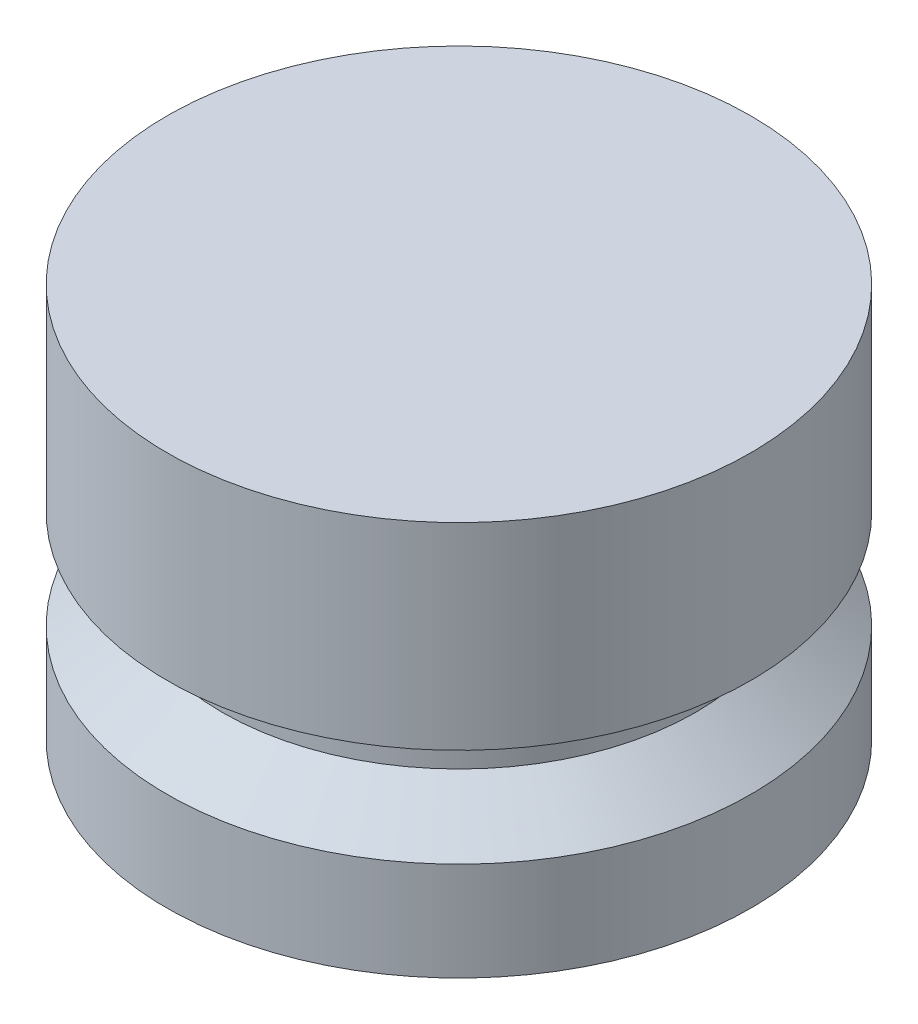
ISO-10303-21;
HEADER;
FILE_DESCRIPTION(('STEP AP214'),'2;1');
FILE_NAME('part.step','',(''),(''),'','','');
FILE_SCHEMA(('AUTOMOTIVE_DESIGN { 1 0 10303 214 1 1 1 1 }'));
ENDSEC;
DATA;
#1=APPLICATION_CONTEXT('core data for automotive mechanical design processes');
#2=APPLICATION_PROTOCOL_DEFINITION('international standard','automotive_design',2000,#1);
#3=PRODUCT_CONTEXT('',#1,'mechanical');
#4=PRODUCT('Part','Part','',(#3));
#5=PRODUCT_RELATED_PRODUCT_CATEGORY('part','',(#4));
#6=PRODUCT_DEFINITION_FORMATION('','',#4);
#7=PRODUCT_DEFINITION_CONTEXT('part definition',#1,'design');
#8=PRODUCT_DEFINITION('design','',#6,#7);
#9=PRODUCT_DEFINITION_SHAPE('','',#8);
#10=(LENGTH_UNIT() NAMED_UNIT(*) SI_UNIT(.MILLI.,.METRE.));
#11=(NAMED_UNIT(*) PLANE_ANGLE_UNIT() SI_UNIT($,.RADIAN.));
#12=(NAMED_UNIT(*) SI_UNIT($,.STERADIAN.) SOLID_ANGLE_UNIT());
#13=UNCERTAINTY_MEASURE_WITH_UNIT(LENGTH_MEASURE(1.E-05),#10,'distance_accuracy_value','');
#14=(GEOMETRIC_REPRESENTATION_CONTEXT(3) GLOBAL_UNCERTAINTY_ASSIGNED_CONTEXT((#13)) GLOBAL_UNIT_ASSIGNED_CONTEXT((#10,
#11,#12)) REPRESENTATION_CONTEXT('',''));
#15=CARTESIAN_POINT('',(0.,0.,0.));
#16=DIRECTION('',(0.,0.,1.));
#17=DIRECTION('',(1.,0.,0.));
#18=AXIS2_PLACEMENT_3D('',#15,#16,#17);
#19=CARTESIAN_POINT('',(0.,0.,0.));
#20=DIRECTION('',(0.,1.,0.));
#21=DIRECTION('',(0.,0.,1.));
#22=AXIS2_PLACEMENT_3D('',#19,#20,#21);
#23=PLANE('',#22);
#24=CARTESIAN_POINT('',(0.,0.,0.));
#25=DIRECTION('',(0.,-1.,0.));
#26=DIRECTION('',(0.,0.,-1.));
#27=AXIS2_PLACEMENT_3D('',#24,#25,#26);
#28=CIRCLE('',#27,9.398);
#29=CARTESIAN_POINT('',(0.,0.,-9.398));
#30=VERTEX_POINT('',#29);
#31=EDGE_CURVE('E10',#30,#30,#28,.T.);
#32=ORIENTED_EDGE('',*,*,#31,.T.);
#33=EDGE_LOOP('',(#32));
#34=FACE_BOUND('',#33,.T.);
#35=ADVANCED_FACE('F30',(#34),#23,.F.);
#36=CARTESIAN_POINT('',(0.,0.,0.));
#37=DIRECTION('',(0.,-1.,0.));
#38=DIRECTION('',(0.,0.,-1.));
#39=AXIS2_PLACEMENT_3D('',#36,#37,#38);
#40=CYLINDRICAL_SURFACE('',#39,9.398);
#41=ORIENTED_EDGE('',*,*,#31,.F.);
#42=EDGE_LOOP('',(#41));
#43=FACE_BOUND('',#42,.T.);
#44=CARTESIAN_POINT('',(0.,3.175,0.));
#45=DIRECTION('',(0.,-1.,0.));
#46=DIRECTION('',(0.,0.,-1.));
#47=AXIS2_PLACEMENT_3D('',#44,#45,#46);
#48=CIRCLE('',#47,9.398);
#49=CARTESIAN_POINT('',(0.,3.175,-9.398));
#50=VERTEX_POINT('',#49);
#51=EDGE_CURVE('E36',#50,#50,#48,.T.);
#52=ORIENTED_EDGE('',*,*,#51,.T.);
#53=EDGE_LOOP('',(#52));
#54=FACE_BOUND('',#53,.T.);
#55=ADVANCED_FACE('F68',(#43,#54),#40,.T.);
#56=CARTESIAN_POINT('',(0.,4.572,0.));
#57=DIRECTION('',(0.,-1.,0.));
#58=DIRECTION('',(0.,0.,-1.));
#59=AXIS2_PLACEMENT_3D('',#56,#57,#58);
#60=CONICAL_SURFACE('',#59,7.62,0.904827089415787);
#61=ORIENTED_EDGE('',*,*,#51,.F.);
#62=EDGE_LOOP('',(#61));
#63=FACE_BOUND('',#62,.T.);
#64=CARTESIAN_POINT('',(0.,4.572,0.));
#65=DIRECTION('',(0.,-1.,0.));
#66=DIRECTION('',(0.,0.,-1.));
#67=AXIS2_PLACEMENT_3D('',#64,#65,#66);
#68=CIRCLE('',#67,7.62);
#69=CARTESIAN_POINT('',(0.,4.572,-7.62));
#70=VERTEX_POINT('',#69);
#71=EDGE_CURVE('E40',#70,#70,#68,.T.);
#72=ORIENTED_EDGE('',*,*,#71,.T.);
#73=EDGE_LOOP('',(#72));
#74=FACE_BOUND('',#73,.T.);
#75=ADVANCED_FACE('F72',(#63,#74),#60,.T.);
#76=CARTESIAN_POINT('',(0.,0.,0.));
#77=DIRECTION('',(0.,-1.,0.));
#78=DIRECTION('',(0.,0.,-1.));
#79=AXIS2_PLACEMENT_3D('',#76,#77,#78);
#80=CYLINDRICAL_SURFACE('',#79,7.62);
#81=ORIENTED_EDGE('',*,*,#71,.F.);
#82=EDGE_LOOP('',(#81));
#83=FACE_BOUND('',#82,.T.);
#84=CARTESIAN_POINT('',(0.,6.35,0.));
#85=DIRECTION('',(0.,-1.,0.));
#86=DIRECTION('',(0.,0.,-1.));
#87=AXIS2_PLACEMENT_3D('',#84,#85,#86);
#88=CIRCLE('',#87,7.62);
#89=CARTESIAN_POINT('',(0.,6.35,-7.62));
#90=VERTEX_POINT('',#89);
#91=EDGE_CURVE('E44',#90,#90,#88,.T.);
#92=ORIENTED_EDGE('',*,*,#91,.T.);
#93=EDGE_LOOP('',(#92));
#94=FACE_BOUND('',#93,.T.);
#95=ADVANCED_FACE('F77',(#83,#94),#80,.T.);
#96=CARTESIAN_POINT('',(-7.62,6.35,0.));
#97=DIRECTION('',(0.,1.,0.));
#98=DIRECTION('',(0.,0.,1.));
#99=AXIS2_PLACEMENT_3D('',#96,#97,#98);
#100=PLANE('',#99);
#101=ORIENTED_EDGE('',*,*,#91,.F.);
#102=EDGE_LOOP('',(#101));
#103=FACE_BOUND('',#102,.T.);
#104=CARTESIAN_POINT('',(0.,6.35,0.));
#105=DIRECTION('',(0.,-1.,0.));
#106=DIRECTION('',(0.,0.,-1.));
#107=AXIS2_PLACEMENT_3D('',#104,#105,#106);
#108=CIRCLE('',#107,9.398);
#109=CARTESIAN_POINT('',(0.,6.35,-9.398));
#110=VERTEX_POINT('',#109);
#111=EDGE_CURVE('E49',#110,#110,#108,.T.);
#112=ORIENTED_EDGE('',*,*,#111,.T.);
#113=EDGE_LOOP('',(#112));
#114=FACE_BOUND('',#113,.T.);
#115=ADVANCED_FACE('F64',(#103,#114),#100,.F.);
#116=CARTESIAN_POINT('',(0.,0.,0.));
#117=DIRECTION('',(0.,-1.,0.));
#118=DIRECTION('',(0.,0.,-1.));
#119=AXIS2_PLACEMENT_3D('',#116,#117,#118);
#120=CYLINDRICAL_SURFACE('',#119,9.398);
#121=ORIENTED_EDGE('',*,*,#111,.F.);
#122=EDGE_LOOP('',(#121));
#123=FACE_BOUND('',#122,.T.);
#124=CARTESIAN_POINT('',(0.,12.7,0.));
#125=DIRECTION('',(0.,-1.,0.));
#126=DIRECTION('',(0.,0.,-1.));
#127=AXIS2_PLACEMENT_3D('',#124,#125,#126);
#128=CIRCLE('',#127,9.398);
#129=CARTESIAN_POINT('',(0.,12.7,-9.398));
#130=VERTEX_POINT('',#129);
#131=EDGE_CURVE('E52',#130,#130,#128,.T.);
#132=ORIENTED_EDGE('',*,*,#131,.T.);
#133=EDGE_LOOP('',(#132));
#134=FACE_BOUND('',#133,.T.);
#135=ADVANCED_FACE('F56',(#123,#134),#120,.T.);
#136=CARTESIAN_POINT('',(-9.398,12.7,0.));
#137=DIRECTION('',(0.,-1.,0.));
#138=DIRECTION('',(0.,0.,-1.));
#139=AXIS2_PLACEMENT_3D('',#136,#137,#138);
#140=PLANE('',#139);
#141=ORIENTED_EDGE('',*,*,#131,.F.);
#142=EDGE_LOOP('',(#141));
#143=FACE_BOUND('',#142,.T.);
#144=ADVANCED_FACE('F58',(#143),#140,.F.);
#145=CLOSED_SHELL('',(#35,#55,#75,#95,#115,#135,#144));
#146=MANIFOLD_SOLID_BREP('B2',#145);
#147=ADVANCED_BREP_SHAPE_REPRESENTATION('',(#18,#146),#14);
#148=SHAPE_DEFINITION_REPRESENTATION(#9,#147);
ENDSEC;
END-ISO-10303-21;
